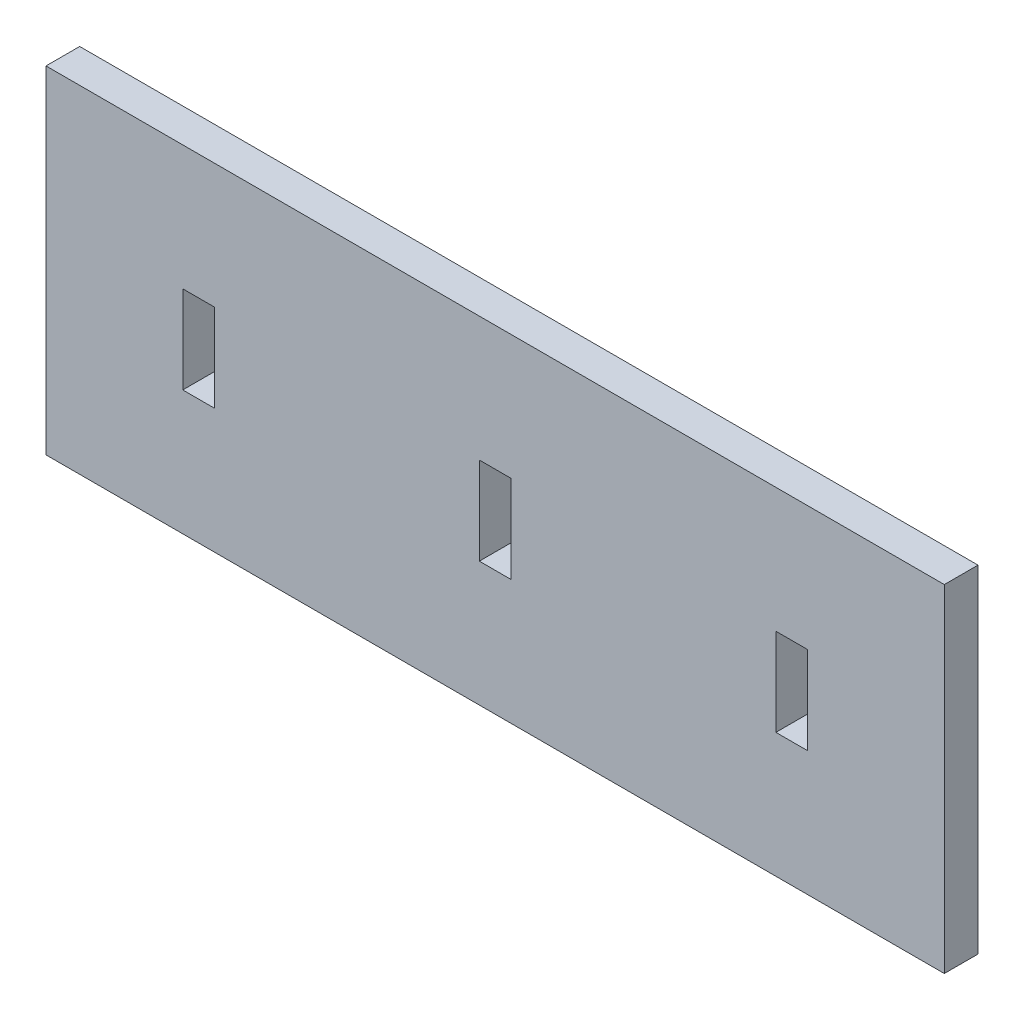
ISO-10303-21;
HEADER;
FILE_DESCRIPTION(('STEP AP214'),'2;1');
FILE_NAME('part.step','',(''),(''),'','','');
FILE_SCHEMA(('AUTOMOTIVE_DESIGN { 1 0 10303 214 1 1 1 1 }'));
ENDSEC;
DATA;
#1=APPLICATION_CONTEXT('core data for automotive mechanical design processes');
#2=APPLICATION_PROTOCOL_DEFINITION('international standard','automotive_design',2000,#1);
#3=PRODUCT_CONTEXT('',#1,'mechanical');
#4=PRODUCT('Part','Part','',(#3));
#5=PRODUCT_RELATED_PRODUCT_CATEGORY('part','',(#4));
#6=PRODUCT_DEFINITION_FORMATION('','',#4);
#7=PRODUCT_DEFINITION_CONTEXT('part definition',#1,'design');
#8=PRODUCT_DEFINITION('design','',#6,#7);
#9=PRODUCT_DEFINITION_SHAPE('','',#8);
#10=(LENGTH_UNIT() NAMED_UNIT(*) SI_UNIT(.MILLI.,.METRE.));
#11=(NAMED_UNIT(*) PLANE_ANGLE_UNIT() SI_UNIT($,.RADIAN.));
#12=(NAMED_UNIT(*) SI_UNIT($,.STERADIAN.) SOLID_ANGLE_UNIT());
#13=UNCERTAINTY_MEASURE_WITH_UNIT(LENGTH_MEASURE(1.E-05),#10,'distance_accuracy_value','');
#14=(GEOMETRIC_REPRESENTATION_CONTEXT(3) GLOBAL_UNCERTAINTY_ASSIGNED_CONTEXT((#13)) GLOBAL_UNIT_ASSIGNED_CONTEXT((#10,
#11,#12)) REPRESENTATION_CONTEXT('',''));
#15=CARTESIAN_POINT('',(0.,0.,0.));
#16=DIRECTION('',(0.,0.,1.));
#17=DIRECTION('',(1.,0.,0.));
#18=AXIS2_PLACEMENT_3D('',#15,#16,#17);
#19=CARTESIAN_POINT('',(0.,0.,3.));
#20=DIRECTION('',(0.,0.,-1.));
#21=DIRECTION('',(-1.,0.,0.));
#22=AXIS2_PLACEMENT_3D('',#19,#20,#21);
#23=PLANE('',#22);
#24=DIRECTION('',(0.,-1.,0.));
#25=VECTOR('',#24,1.);
#26=CARTESIAN_POINT('',(25.,3.9,3.));
#27=LINE('',#26,#25);
#28=CARTESIAN_POINT('',(25.,3.9,3.));
#29=VERTEX_POINT('',#28);
#30=CARTESIAN_POINT('',(25.,-3.9,3.));
#31=VERTEX_POINT('',#30);
#32=EDGE_CURVE('E201',#29,#31,#27,.T.);
#33=ORIENTED_EDGE('',*,*,#32,.F.);
#34=DIRECTION('',(-1.,0.,0.));
#35=VECTOR('',#34,1.);
#36=CARTESIAN_POINT('',(25.,3.9,3.));
#37=LINE('',#36,#35);
#38=CARTESIAN_POINT('',(27.82,3.9,3.));
#39=VERTEX_POINT('',#38);
#40=EDGE_CURVE('E212',#39,#29,#37,.T.);
#41=ORIENTED_EDGE('',*,*,#40,.F.);
#42=DIRECTION('',(0.,1.,0.));
#43=VECTOR('',#42,1.);
#44=CARTESIAN_POINT('',(27.82,3.9,3.));
#45=LINE('',#44,#43);
#46=CARTESIAN_POINT('',(27.82,-3.9,3.));
#47=VERTEX_POINT('',#46);
#48=EDGE_CURVE('E208',#47,#39,#45,.T.);
#49=ORIENTED_EDGE('',*,*,#48,.F.);
#50=DIRECTION('',(1.,0.,0.));
#51=VECTOR('',#50,1.);
#52=CARTESIAN_POINT('',(25.,-3.9,3.));
#53=LINE('',#52,#51);
#54=EDGE_CURVE('E204',#31,#47,#53,.T.);
#55=ORIENTED_EDGE('',*,*,#54,.F.);
#56=EDGE_LOOP('',(#33,#41,#49,#55));
#57=FACE_BOUND('',#56,.T.);
#58=DIRECTION('',(0.,1.,0.));
#59=VECTOR('',#58,1.);
#60=CARTESIAN_POINT('',(40.,-15.,3.));
#61=LINE('',#60,#59);
#62=CARTESIAN_POINT('',(40.,-15.,3.));
#63=VERTEX_POINT('',#62);
#64=CARTESIAN_POINT('',(40.,15.,3.));
#65=VERTEX_POINT('',#64);
#66=EDGE_CURVE('E287',#63,#65,#61,.T.);
#67=ORIENTED_EDGE('',*,*,#66,.T.);
#68=DIRECTION('',(-1.,0.,0.));
#69=VECTOR('',#68,1.);
#70=CARTESIAN_POINT('',(-40.,15.,3.));
#71=LINE('',#70,#69);
#72=CARTESIAN_POINT('',(-40.,15.,3.));
#73=VERTEX_POINT('',#72);
#74=EDGE_CURVE('E291',#65,#73,#71,.T.);
#75=ORIENTED_EDGE('',*,*,#74,.T.);
#76=DIRECTION('',(0.,-1.,0.));
#77=VECTOR('',#76,1.);
#78=CARTESIAN_POINT('',(-40.,-15.,3.));
#79=LINE('',#78,#77);
#80=CARTESIAN_POINT('',(-40.,-15.,3.));
#81=VERTEX_POINT('',#80);
#82=EDGE_CURVE('E295',#73,#81,#79,.T.);
#83=ORIENTED_EDGE('',*,*,#82,.T.);
#84=DIRECTION('',(1.,0.,0.));
#85=VECTOR('',#84,1.);
#86=CARTESIAN_POINT('',(-40.,-15.,3.));
#87=LINE('',#86,#85);
#88=EDGE_CURVE('E298',#81,#63,#87,.T.);
#89=ORIENTED_EDGE('',*,*,#88,.T.);
#90=EDGE_LOOP('',(#67,#75,#83,#89));
#91=FACE_BOUND('',#90,.T.);
#92=DIRECTION('',(0.,-1.,0.));
#93=VECTOR('',#92,1.);
#94=CARTESIAN_POINT('',(-27.82,3.9,3.));
#95=LINE('',#94,#93);
#96=CARTESIAN_POINT('',(-27.82,3.9,3.));
#97=VERTEX_POINT('',#96);
#98=CARTESIAN_POINT('',(-27.82,-3.9,3.));
#99=VERTEX_POINT('',#98);
#100=EDGE_CURVE('E244',#97,#99,#95,.T.);
#101=ORIENTED_EDGE('',*,*,#100,.F.);
#102=DIRECTION('',(-1.,0.,0.));
#103=VECTOR('',#102,1.);
#104=CARTESIAN_POINT('',(-27.82,3.9,3.));
#105=LINE('',#104,#103);
#106=CARTESIAN_POINT('',(-25.,3.90000000000001,3.));
#107=VERTEX_POINT('',#106);
#108=EDGE_CURVE('E255',#107,#97,#105,.T.);
#109=ORIENTED_EDGE('',*,*,#108,.F.);
#110=DIRECTION('',(0.,1.,0.));
#111=VECTOR('',#110,1.);
#112=CARTESIAN_POINT('',(-25.,3.90000000000001,3.));
#113=LINE('',#112,#111);
#114=CARTESIAN_POINT('',(-25.,-3.90000000000001,3.));
#115=VERTEX_POINT('',#114);
#116=EDGE_CURVE('E251',#115,#107,#113,.T.);
#117=ORIENTED_EDGE('',*,*,#116,.F.);
#118=DIRECTION('',(1.,0.,0.));
#119=VECTOR('',#118,1.);
#120=CARTESIAN_POINT('',(-27.82,-3.9,3.));
#121=LINE('',#120,#119);
#122=EDGE_CURVE('E247',#99,#115,#121,.T.);
#123=ORIENTED_EDGE('',*,*,#122,.F.);
#124=EDGE_LOOP('',(#101,#109,#117,#123));
#125=FACE_BOUND('',#124,.T.);
#126=DIRECTION('',(0.,1.,0.));
#127=VECTOR('',#126,1.);
#128=CARTESIAN_POINT('',(1.41,-3.9,3.));
#129=LINE('',#128,#127);
#130=CARTESIAN_POINT('',(1.41,-3.9,3.));
#131=VERTEX_POINT('',#130);
#132=CARTESIAN_POINT('',(1.41,3.9,3.));
#133=VERTEX_POINT('',#132);
#134=EDGE_CURVE('E153',#131,#133,#129,.T.);
#135=ORIENTED_EDGE('',*,*,#134,.F.);
#136=DIRECTION('',(1.,0.,0.));
#137=VECTOR('',#136,1.);
#138=CARTESIAN_POINT('',(-1.41,-3.9,3.));
#139=LINE('',#138,#137);
#140=CARTESIAN_POINT('',(-1.41,-3.9,3.));
#141=VERTEX_POINT('',#140);
#142=EDGE_CURVE('E179',#141,#131,#139,.T.);
#143=ORIENTED_EDGE('',*,*,#142,.F.);
#144=DIRECTION('',(0.,-1.,0.));
#145=VECTOR('',#144,1.);
#146=CARTESIAN_POINT('',(-1.41,-3.9,3.));
#147=LINE('',#146,#145);
#148=CARTESIAN_POINT('',(-1.41,3.9,3.));
#149=VERTEX_POINT('',#148);
#150=EDGE_CURVE('E175',#149,#141,#147,.T.);
#151=ORIENTED_EDGE('',*,*,#150,.F.);
#152=DIRECTION('',(-1.,0.,0.));
#153=VECTOR('',#152,1.);
#154=CARTESIAN_POINT('',(-1.41,3.9,3.));
#155=LINE('',#154,#153);
#156=EDGE_CURVE('E162',#133,#149,#155,.T.);
#157=ORIENTED_EDGE('',*,*,#156,.F.);
#158=EDGE_LOOP('',(#135,#143,#151,#157));
#159=FACE_BOUND('',#158,.T.);
#160=ADVANCED_FACE('F39',(#57,#91,#125,#159),#23,.F.);
#161=CARTESIAN_POINT('',(0.,0.,0.));
#162=DIRECTION('',(0.,0.,-1.));
#163=DIRECTION('',(-1.,0.,0.));
#164=AXIS2_PLACEMENT_3D('',#161,#162,#163);
#165=PLANE('',#164);
#166=DIRECTION('',(0.,1.,0.));
#167=VECTOR('',#166,1.);
#168=CARTESIAN_POINT('',(40.,-15.,0.));
#169=LINE('',#168,#167);
#170=CARTESIAN_POINT('',(40.,-15.,0.));
#171=VERTEX_POINT('',#170);
#172=CARTESIAN_POINT('',(40.,15.,0.));
#173=VERTEX_POINT('',#172);
#174=EDGE_CURVE('E286',#171,#173,#169,.T.);
#175=ORIENTED_EDGE('',*,*,#174,.F.);
#176=DIRECTION('',(1.,0.,0.));
#177=VECTOR('',#176,1.);
#178=CARTESIAN_POINT('',(-40.,-15.,0.));
#179=LINE('',#178,#177);
#180=CARTESIAN_POINT('',(-40.,-15.,0.));
#181=VERTEX_POINT('',#180);
#182=EDGE_CURVE('E292',#181,#171,#179,.T.);
#183=ORIENTED_EDGE('',*,*,#182,.F.);
#184=DIRECTION('',(0.,-1.,0.));
#185=VECTOR('',#184,1.);
#186=CARTESIAN_POINT('',(-40.,-15.,0.));
#187=LINE('',#186,#185);
#188=CARTESIAN_POINT('',(-40.,15.,0.));
#189=VERTEX_POINT('',#188);
#190=EDGE_CURVE('E308',#189,#181,#187,.T.);
#191=ORIENTED_EDGE('',*,*,#190,.F.);
#192=DIRECTION('',(-1.,0.,0.));
#193=VECTOR('',#192,1.);
#194=CARTESIAN_POINT('',(-40.,15.,0.));
#195=LINE('',#194,#193);
#196=EDGE_CURVE('E305',#173,#189,#195,.T.);
#197=ORIENTED_EDGE('',*,*,#196,.F.);
#198=EDGE_LOOP('',(#175,#183,#191,#197));
#199=FACE_BOUND('',#198,.T.);
#200=DIRECTION('',(-1.,0.,0.));
#201=VECTOR('',#200,1.);
#202=CARTESIAN_POINT('',(-27.82,3.9,0.));
#203=LINE('',#202,#201);
#204=CARTESIAN_POINT('',(-25.,3.90000000000001,0.));
#205=VERTEX_POINT('',#204);
#206=CARTESIAN_POINT('',(-27.82,3.9,0.));
#207=VERTEX_POINT('',#206);
#208=EDGE_CURVE('E248',#205,#207,#203,.T.);
#209=ORIENTED_EDGE('',*,*,#208,.T.);
#210=DIRECTION('',(0.,-1.,0.));
#211=VECTOR('',#210,1.);
#212=CARTESIAN_POINT('',(-27.82,3.9,0.));
#213=LINE('',#212,#211);
#214=CARTESIAN_POINT('',(-27.82,-3.9,0.));
#215=VERTEX_POINT('',#214);
#216=EDGE_CURVE('E243',#207,#215,#213,.T.);
#217=ORIENTED_EDGE('',*,*,#216,.T.);
#218=DIRECTION('',(1.,0.,0.));
#219=VECTOR('',#218,1.);
#220=CARTESIAN_POINT('',(-27.82,-3.9,0.));
#221=LINE('',#220,#219);
#222=CARTESIAN_POINT('',(-25.,-3.90000000000001,0.));
#223=VERTEX_POINT('',#222);
#224=EDGE_CURVE('E262',#215,#223,#221,.T.);
#225=ORIENTED_EDGE('',*,*,#224,.T.);
#226=DIRECTION('',(0.,1.,0.));
#227=VECTOR('',#226,1.);
#228=CARTESIAN_POINT('',(-25.,3.90000000000001,0.));
#229=LINE('',#228,#227);
#230=EDGE_CURVE('E266',#223,#205,#229,.T.);
#231=ORIENTED_EDGE('',*,*,#230,.T.);
#232=EDGE_LOOP('',(#209,#217,#225,#231));
#233=FACE_BOUND('',#232,.T.);
#234=DIRECTION('',(-1.,0.,0.));
#235=VECTOR('',#234,1.);
#236=CARTESIAN_POINT('',(25.,3.9,0.));
#237=LINE('',#236,#235);
#238=CARTESIAN_POINT('',(27.82,3.9,0.));
#239=VERTEX_POINT('',#238);
#240=CARTESIAN_POINT('',(25.,3.9,0.));
#241=VERTEX_POINT('',#240);
#242=EDGE_CURVE('E205',#239,#241,#237,.T.);
#243=ORIENTED_EDGE('',*,*,#242,.T.);
#244=DIRECTION('',(0.,-1.,0.));
#245=VECTOR('',#244,1.);
#246=CARTESIAN_POINT('',(25.,3.9,0.));
#247=LINE('',#246,#245);
#248=CARTESIAN_POINT('',(25.,-3.9,0.));
#249=VERTEX_POINT('',#248);
#250=EDGE_CURVE('E171',#241,#249,#247,.T.);
#251=ORIENTED_EDGE('',*,*,#250,.T.);
#252=DIRECTION('',(1.,0.,0.));
#253=VECTOR('',#252,1.);
#254=CARTESIAN_POINT('',(25.,-3.9,0.));
#255=LINE('',#254,#253);
#256=CARTESIAN_POINT('',(27.82,-3.9,0.));
#257=VERTEX_POINT('',#256);
#258=EDGE_CURVE('E219',#249,#257,#255,.T.);
#259=ORIENTED_EDGE('',*,*,#258,.T.);
#260=DIRECTION('',(0.,1.,0.));
#261=VECTOR('',#260,1.);
#262=CARTESIAN_POINT('',(27.82,3.9,0.));
#263=LINE('',#262,#261);
#264=EDGE_CURVE('E223',#257,#239,#263,.T.);
#265=ORIENTED_EDGE('',*,*,#264,.T.);
#266=EDGE_LOOP('',(#243,#251,#259,#265));
#267=FACE_BOUND('',#266,.T.);
#268=DIRECTION('',(1.,0.,0.));
#269=VECTOR('',#268,1.);
#270=CARTESIAN_POINT('',(-1.41,-3.9,0.));
#271=LINE('',#270,#269);
#272=CARTESIAN_POINT('',(-1.41,-3.9,0.));
#273=VERTEX_POINT('',#272);
#274=CARTESIAN_POINT('',(1.41,-3.9,0.));
#275=VERTEX_POINT('',#274);
#276=EDGE_CURVE('E163',#273,#275,#271,.T.);
#277=ORIENTED_EDGE('',*,*,#276,.T.);
#278=DIRECTION('',(0.,1.,0.));
#279=VECTOR('',#278,1.);
#280=CARTESIAN_POINT('',(1.41,-3.9,0.));
#281=LINE('',#280,#279);
#282=CARTESIAN_POINT('',(1.41,3.9,0.));
#283=VERTEX_POINT('',#282);
#284=EDGE_CURVE('E63',#275,#283,#281,.T.);
#285=ORIENTED_EDGE('',*,*,#284,.T.);
#286=DIRECTION('',(-1.,0.,0.));
#287=VECTOR('',#286,1.);
#288=CARTESIAN_POINT('',(-1.41,3.9,0.));
#289=LINE('',#288,#287);
#290=CARTESIAN_POINT('',(-1.41,3.9,0.));
#291=VERTEX_POINT('',#290);
#292=EDGE_CURVE('E169',#283,#291,#289,.T.);
#293=ORIENTED_EDGE('',*,*,#292,.T.);
#294=DIRECTION('',(0.,-1.,0.));
#295=VECTOR('',#294,1.);
#296=CARTESIAN_POINT('',(-1.41,-3.9,0.));
#297=LINE('',#296,#295);
#298=EDGE_CURVE('E188',#291,#273,#297,.T.);
#299=ORIENTED_EDGE('',*,*,#298,.T.);
#300=EDGE_LOOP('',(#277,#285,#293,#299));
#301=FACE_BOUND('',#300,.T.);
#302=ADVANCED_FACE('F331',(#199,#233,#267,#301),#165,.T.);
#303=CARTESIAN_POINT('',(40.,-15.,3.));
#304=DIRECTION('',(-1.,0.,0.));
#305=DIRECTION('',(0.,0.,1.));
#306=AXIS2_PLACEMENT_3D('',#303,#304,#305);
#307=PLANE('',#306);
#308=ORIENTED_EDGE('',*,*,#174,.T.);
#309=DIRECTION('',(0.,0.,-1.));
#310=VECTOR('',#309,1.);
#311=CARTESIAN_POINT('',(40.,15.,3.));
#312=LINE('',#311,#310);
#313=EDGE_CURVE('E11',#65,#173,#312,.T.);
#314=ORIENTED_EDGE('',*,*,#313,.F.);
#315=ORIENTED_EDGE('',*,*,#66,.F.);
#316=DIRECTION('',(0.,0.,-1.));
#317=VECTOR('',#316,1.);
#318=CARTESIAN_POINT('',(40.,-15.,3.));
#319=LINE('',#318,#317);
#320=EDGE_CURVE('E301',#63,#171,#319,.T.);
#321=ORIENTED_EDGE('',*,*,#320,.T.);
#322=EDGE_LOOP('',(#308,#314,#315,#321));
#323=FACE_BOUND('',#322,.T.);
#324=ADVANCED_FACE('F41',(#323),#307,.F.);
#325=CARTESIAN_POINT('',(-40.,15.,3.));
#326=DIRECTION('',(0.,-1.,0.));
#327=DIRECTION('',(0.,0.,-1.));
#328=AXIS2_PLACEMENT_3D('',#325,#326,#327);
#329=PLANE('',#328);
#330=ORIENTED_EDGE('',*,*,#196,.T.);
#331=DIRECTION('',(0.,0.,-1.));
#332=VECTOR('',#331,1.);
#333=CARTESIAN_POINT('',(-40.,15.,3.));
#334=LINE('',#333,#332);
#335=EDGE_CURVE('E48',#73,#189,#334,.T.);
#336=ORIENTED_EDGE('',*,*,#335,.F.);
#337=ORIENTED_EDGE('',*,*,#74,.F.);
#338=ORIENTED_EDGE('',*,*,#313,.T.);
#339=EDGE_LOOP('',(#330,#336,#337,#338));
#340=FACE_BOUND('',#339,.T.);
#341=ADVANCED_FACE('F342',(#340),#329,.F.);
#342=CARTESIAN_POINT('',(-40.,-15.,3.));
#343=DIRECTION('',(1.,0.,0.));
#344=DIRECTION('',(0.,0.,-1.));
#345=AXIS2_PLACEMENT_3D('',#342,#343,#344);
#346=PLANE('',#345);
#347=ORIENTED_EDGE('',*,*,#190,.T.);
#348=DIRECTION('',(0.,0.,-1.));
#349=VECTOR('',#348,1.);
#350=CARTESIAN_POINT('',(-40.,-15.,3.));
#351=LINE('',#350,#349);
#352=EDGE_CURVE('E316',#81,#181,#351,.T.);
#353=ORIENTED_EDGE('',*,*,#352,.F.);
#354=ORIENTED_EDGE('',*,*,#82,.F.);
#355=ORIENTED_EDGE('',*,*,#335,.T.);
#356=EDGE_LOOP('',(#347,#353,#354,#355));
#357=FACE_BOUND('',#356,.T.);
#358=ADVANCED_FACE('F325',(#357),#346,.F.);
#359=CARTESIAN_POINT('',(-40.,-15.,3.));
#360=DIRECTION('',(0.,1.,0.));
#361=DIRECTION('',(0.,0.,1.));
#362=AXIS2_PLACEMENT_3D('',#359,#360,#361);
#363=PLANE('',#362);
#364=ORIENTED_EDGE('',*,*,#182,.T.);
#365=ORIENTED_EDGE('',*,*,#320,.F.);
#366=ORIENTED_EDGE('',*,*,#88,.F.);
#367=ORIENTED_EDGE('',*,*,#352,.T.);
#368=EDGE_LOOP('',(#364,#365,#366,#367));
#369=FACE_BOUND('',#368,.T.);
#370=ADVANCED_FACE('F335',(#369),#363,.F.);
#371=CARTESIAN_POINT('',(-27.82,3.9,3.));
#372=DIRECTION('',(1.,0.,0.));
#373=DIRECTION('',(0.,0.,-1.));
#374=AXIS2_PLACEMENT_3D('',#371,#372,#373);
#375=PLANE('',#374);
#376=ORIENTED_EDGE('',*,*,#216,.F.);
#377=DIRECTION('',(0.,0.,-1.));
#378=VECTOR('',#377,1.);
#379=CARTESIAN_POINT('',(-27.82,3.9,3.));
#380=LINE('',#379,#378);
#381=EDGE_CURVE('E258',#97,#207,#380,.T.);
#382=ORIENTED_EDGE('',*,*,#381,.F.);
#383=ORIENTED_EDGE('',*,*,#100,.T.);
#384=DIRECTION('',(0.,0.,-1.));
#385=VECTOR('',#384,1.);
#386=CARTESIAN_POINT('',(-27.82,-3.9,3.));
#387=LINE('',#386,#385);
#388=EDGE_CURVE('E282',#99,#215,#387,.T.);
#389=ORIENTED_EDGE('',*,*,#388,.T.);
#390=EDGE_LOOP('',(#376,#382,#383,#389));
#391=FACE_BOUND('',#390,.T.);
#392=ADVANCED_FACE('F358',(#391),#375,.T.);
#393=CARTESIAN_POINT('',(-27.82,-3.9,3.));
#394=DIRECTION('',(0.,1.,0.));
#395=DIRECTION('',(-1.,0.,0.));
#396=AXIS2_PLACEMENT_3D('',#393,#394,#395);
#397=PLANE('',#396);
#398=ORIENTED_EDGE('',*,*,#224,.F.);
#399=ORIENTED_EDGE('',*,*,#388,.F.);
#400=ORIENTED_EDGE('',*,*,#122,.T.);
#401=DIRECTION('',(0.,0.,-1.));
#402=VECTOR('',#401,1.);
#403=CARTESIAN_POINT('',(-25.,-3.90000000000001,3.));
#404=LINE('',#403,#402);
#405=EDGE_CURVE('E279',#115,#223,#404,.T.);
#406=ORIENTED_EDGE('',*,*,#405,.T.);
#407=EDGE_LOOP('',(#398,#399,#400,#406));
#408=FACE_BOUND('',#407,.T.);
#409=ADVANCED_FACE('F365',(#408),#397,.T.);
#410=CARTESIAN_POINT('',(-25.,3.90000000000001,3.));
#411=DIRECTION('',(-1.,0.,0.));
#412=DIRECTION('',(0.,0.,1.));
#413=AXIS2_PLACEMENT_3D('',#410,#411,#412);
#414=PLANE('',#413);
#415=ORIENTED_EDGE('',*,*,#230,.F.);
#416=ORIENTED_EDGE('',*,*,#405,.F.);
#417=ORIENTED_EDGE('',*,*,#116,.T.);
#418=DIRECTION('',(0.,0.,-1.));
#419=VECTOR('',#418,1.);
#420=CARTESIAN_POINT('',(-25.,3.90000000000001,3.));
#421=LINE('',#420,#419);
#422=EDGE_CURVE('E276',#107,#205,#421,.T.);
#423=ORIENTED_EDGE('',*,*,#422,.T.);
#424=EDGE_LOOP('',(#415,#416,#417,#423));
#425=FACE_BOUND('',#424,.T.);
#426=ADVANCED_FACE('F370',(#425),#414,.T.);
#427=CARTESIAN_POINT('',(-27.82,3.9,3.));
#428=DIRECTION('',(0.,-1.,0.));
#429=DIRECTION('',(1.,0.,0.));
#430=AXIS2_PLACEMENT_3D('',#427,#428,#429);
#431=PLANE('',#430);
#432=ORIENTED_EDGE('',*,*,#208,.F.);
#433=ORIENTED_EDGE('',*,*,#422,.F.);
#434=ORIENTED_EDGE('',*,*,#108,.T.);
#435=ORIENTED_EDGE('',*,*,#381,.T.);
#436=EDGE_LOOP('',(#432,#433,#434,#435));
#437=FACE_BOUND('',#436,.T.);
#438=ADVANCED_FACE('F377',(#437),#431,.T.);
#439=CARTESIAN_POINT('',(25.,3.9,3.));
#440=DIRECTION('',(1.,0.,0.));
#441=DIRECTION('',(0.,0.,-1.));
#442=AXIS2_PLACEMENT_3D('',#439,#440,#441);
#443=PLANE('',#442);
#444=ORIENTED_EDGE('',*,*,#250,.F.);
#445=DIRECTION('',(0.,0.,-1.));
#446=VECTOR('',#445,1.);
#447=CARTESIAN_POINT('',(25.,3.9,3.));
#448=LINE('',#447,#446);
#449=EDGE_CURVE('E215',#29,#241,#448,.T.);
#450=ORIENTED_EDGE('',*,*,#449,.F.);
#451=ORIENTED_EDGE('',*,*,#32,.T.);
#452=DIRECTION('',(0.,0.,-1.));
#453=VECTOR('',#452,1.);
#454=CARTESIAN_POINT('',(25.,-3.9,3.));
#455=LINE('',#454,#453);
#456=EDGE_CURVE('E239',#31,#249,#455,.T.);
#457=ORIENTED_EDGE('',*,*,#456,.T.);
#458=EDGE_LOOP('',(#444,#450,#451,#457));
#459=FACE_BOUND('',#458,.T.);
#460=ADVANCED_FACE('F390',(#459),#443,.T.);
#461=CARTESIAN_POINT('',(25.,-3.9,3.));
#462=DIRECTION('',(0.,1.,0.));
#463=DIRECTION('',(0.,0.,1.));
#464=AXIS2_PLACEMENT_3D('',#461,#462,#463);
#465=PLANE('',#464);
#466=ORIENTED_EDGE('',*,*,#258,.F.);
#467=ORIENTED_EDGE('',*,*,#456,.F.);
#468=ORIENTED_EDGE('',*,*,#54,.T.);
#469=DIRECTION('',(0.,0.,-1.));
#470=VECTOR('',#469,1.);
#471=CARTESIAN_POINT('',(27.82,-3.9,3.));
#472=LINE('',#471,#470);
#473=EDGE_CURVE('E236',#47,#257,#472,.T.);
#474=ORIENTED_EDGE('',*,*,#473,.T.);
#475=EDGE_LOOP('',(#466,#467,#468,#474));
#476=FACE_BOUND('',#475,.T.);
#477=ADVANCED_FACE('F395',(#476),#465,.T.);
#478=CARTESIAN_POINT('',(27.82,3.9,3.));
#479=DIRECTION('',(-1.,0.,0.));
#480=DIRECTION('',(0.,0.,1.));
#481=AXIS2_PLACEMENT_3D('',#478,#479,#480);
#482=PLANE('',#481);
#483=ORIENTED_EDGE('',*,*,#264,.F.);
#484=ORIENTED_EDGE('',*,*,#473,.F.);
#485=ORIENTED_EDGE('',*,*,#48,.T.);
#486=DIRECTION('',(0.,0.,-1.));
#487=VECTOR('',#486,1.);
#488=CARTESIAN_POINT('',(27.82,3.9,3.));
#489=LINE('',#488,#487);
#490=EDGE_CURVE('E233',#39,#239,#489,.T.);
#491=ORIENTED_EDGE('',*,*,#490,.T.);
#492=EDGE_LOOP('',(#483,#484,#485,#491));
#493=FACE_BOUND('',#492,.T.);
#494=ADVANCED_FACE('F399',(#493),#482,.T.);
#495=CARTESIAN_POINT('',(25.,3.9,3.));
#496=DIRECTION('',(0.,-1.,0.));
#497=DIRECTION('',(0.,0.,-1.));
#498=AXIS2_PLACEMENT_3D('',#495,#496,#497);
#499=PLANE('',#498);
#500=ORIENTED_EDGE('',*,*,#242,.F.);
#501=ORIENTED_EDGE('',*,*,#490,.F.);
#502=ORIENTED_EDGE('',*,*,#40,.T.);
#503=ORIENTED_EDGE('',*,*,#449,.T.);
#504=EDGE_LOOP('',(#500,#501,#502,#503));
#505=FACE_BOUND('',#504,.T.);
#506=ADVANCED_FACE('F403',(#505),#499,.T.);
#507=CARTESIAN_POINT('',(1.41,-3.9,3.));
#508=DIRECTION('',(-1.,0.,0.));
#509=DIRECTION('',(0.,0.,1.));
#510=AXIS2_PLACEMENT_3D('',#507,#508,#509);
#511=PLANE('',#510);
#512=ORIENTED_EDGE('',*,*,#284,.F.);
#513=DIRECTION('',(0.,0.,-1.));
#514=VECTOR('',#513,1.);
#515=CARTESIAN_POINT('',(1.41,-3.9,3.));
#516=LINE('',#515,#514);
#517=EDGE_CURVE('E157',#131,#275,#516,.T.);
#518=ORIENTED_EDGE('',*,*,#517,.F.);
#519=ORIENTED_EDGE('',*,*,#134,.T.);
#520=DIRECTION('',(0.,0.,-1.));
#521=VECTOR('',#520,1.);
#522=CARTESIAN_POINT('',(1.41,3.9,3.));
#523=LINE('',#522,#521);
#524=EDGE_CURVE('E156',#133,#283,#523,.T.);
#525=ORIENTED_EDGE('',*,*,#524,.T.);
#526=EDGE_LOOP('',(#512,#518,#519,#525));
#527=FACE_BOUND('',#526,.T.);
#528=ADVANCED_FACE('F155',(#527),#511,.T.);
#529=CARTESIAN_POINT('',(-1.41,3.9,3.));
#530=DIRECTION('',(0.,-1.,0.));
#531=DIRECTION('',(0.,0.,-1.));
#532=AXIS2_PLACEMENT_3D('',#529,#530,#531);
#533=PLANE('',#532);
#534=ORIENTED_EDGE('',*,*,#292,.F.);
#535=ORIENTED_EDGE('',*,*,#524,.F.);
#536=ORIENTED_EDGE('',*,*,#156,.T.);
#537=DIRECTION('',(0.,0.,-1.));
#538=VECTOR('',#537,1.);
#539=CARTESIAN_POINT('',(-1.41,3.9,3.));
#540=LINE('',#539,#538);
#541=EDGE_CURVE('E172',#149,#291,#540,.T.);
#542=ORIENTED_EDGE('',*,*,#541,.T.);
#543=EDGE_LOOP('',(#534,#535,#536,#542));
#544=FACE_BOUND('',#543,.T.);
#545=ADVANCED_FACE('F166',(#544),#533,.T.);
#546=CARTESIAN_POINT('',(-1.41,-3.9,3.));
#547=DIRECTION('',(1.,0.,0.));
#548=DIRECTION('',(0.,0.,-1.));
#549=AXIS2_PLACEMENT_3D('',#546,#547,#548);
#550=PLANE('',#549);
#551=ORIENTED_EDGE('',*,*,#298,.F.);
#552=ORIENTED_EDGE('',*,*,#541,.F.);
#553=ORIENTED_EDGE('',*,*,#150,.T.);
#554=DIRECTION('',(0.,0.,-1.));
#555=VECTOR('',#554,1.);
#556=CARTESIAN_POINT('',(-1.41,-3.9,3.));
#557=LINE('',#556,#555);
#558=EDGE_CURVE('E55',#141,#273,#557,.T.);
#559=ORIENTED_EDGE('',*,*,#558,.T.);
#560=EDGE_LOOP('',(#551,#552,#553,#559));
#561=FACE_BOUND('',#560,.T.);
#562=ADVANCED_FACE('F412',(#561),#550,.T.);
#563=CARTESIAN_POINT('',(-1.41,-3.9,3.));
#564=DIRECTION('',(0.,1.,0.));
#565=DIRECTION('',(0.,0.,1.));
#566=AXIS2_PLACEMENT_3D('',#563,#564,#565);
#567=PLANE('',#566);
#568=ORIENTED_EDGE('',*,*,#276,.F.);
#569=ORIENTED_EDGE('',*,*,#558,.F.);
#570=ORIENTED_EDGE('',*,*,#142,.T.);
#571=ORIENTED_EDGE('',*,*,#517,.T.);
#572=EDGE_LOOP('',(#568,#569,#570,#571));
#573=FACE_BOUND('',#572,.T.);
#574=ADVANCED_FACE('F415',(#573),#567,.T.);
#575=CLOSED_SHELL('',(#160,#302,#324,#341,#358,#370,#392,#409,#426,#438,#460,#477,#494,#506,
#528,#545,#562,#574));
#576=MANIFOLD_SOLID_BREP('B2',#575);
#577=ADVANCED_BREP_SHAPE_REPRESENTATION('',(#18,#576),#14);
#578=SHAPE_DEFINITION_REPRESENTATION(#9,#577);
ENDSEC;
END-ISO-10303-21;
